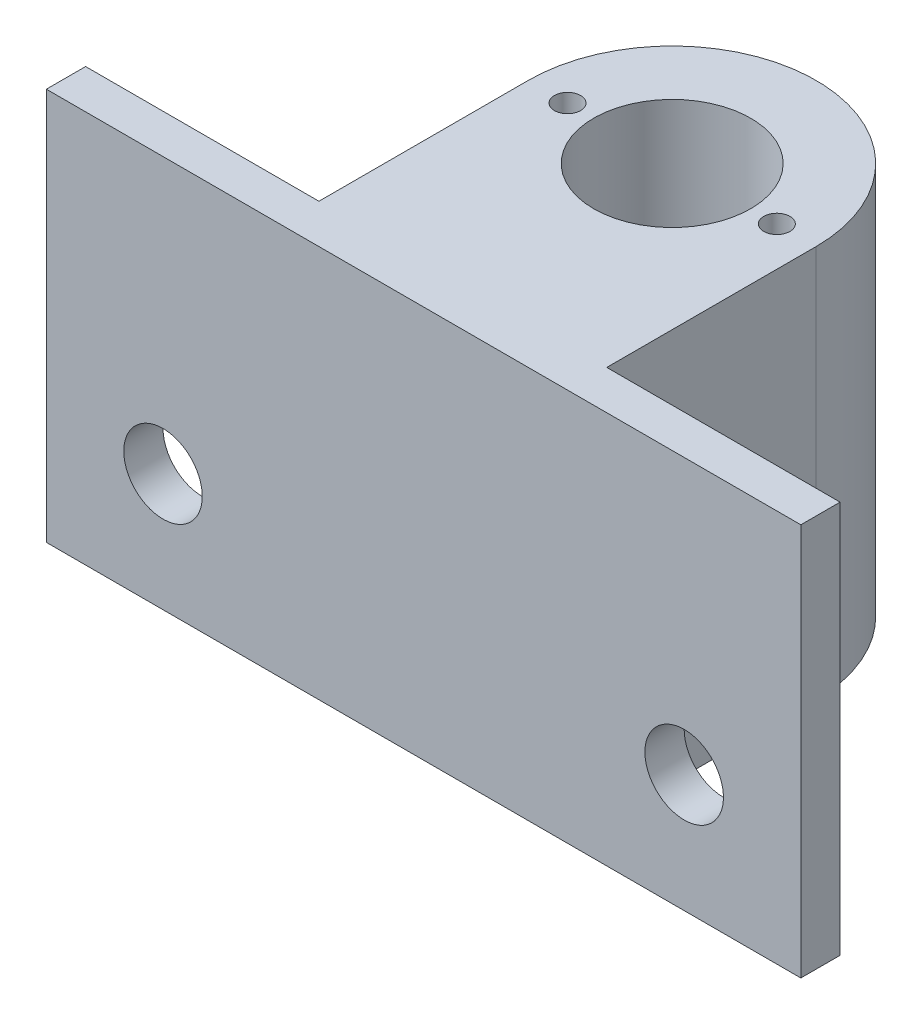
ISO-10303-21;
HEADER;
FILE_DESCRIPTION(('STEP AP214'),'2;1');
FILE_NAME('part.step','',(''),(''),'','','');
FILE_SCHEMA(('AUTOMOTIVE_DESIGN { 1 0 10303 214 1 1 1 1 }'));
ENDSEC;
DATA;
#1=APPLICATION_CONTEXT('core data for automotive mechanical design processes');
#2=APPLICATION_PROTOCOL_DEFINITION('international standard','automotive_design',2000,#1);
#3=PRODUCT_CONTEXT('',#1,'mechanical');
#4=PRODUCT('Part','Part','',(#3));
#5=PRODUCT_RELATED_PRODUCT_CATEGORY('part','',(#4));
#6=PRODUCT_DEFINITION_FORMATION('','',#4);
#7=PRODUCT_DEFINITION_CONTEXT('part definition',#1,'design');
#8=PRODUCT_DEFINITION('design','',#6,#7);
#9=PRODUCT_DEFINITION_SHAPE('','',#8);
#10=(LENGTH_UNIT() NAMED_UNIT(*) SI_UNIT(.MILLI.,.METRE.));
#11=(NAMED_UNIT(*) PLANE_ANGLE_UNIT() SI_UNIT($,.RADIAN.));
#12=(NAMED_UNIT(*) SI_UNIT($,.STERADIAN.) SOLID_ANGLE_UNIT());
#13=UNCERTAINTY_MEASURE_WITH_UNIT(LENGTH_MEASURE(1.E-05),#10,'distance_accuracy_value','');
#14=(GEOMETRIC_REPRESENTATION_CONTEXT(3) GLOBAL_UNCERTAINTY_ASSIGNED_CONTEXT((#13)) GLOBAL_UNIT_ASSIGNED_CONTEXT((#10,
#11,#12)) REPRESENTATION_CONTEXT('',''));
#15=CARTESIAN_POINT('',(0.,0.,0.));
#16=DIRECTION('',(0.,0.,1.));
#17=DIRECTION('',(1.,0.,0.));
#18=AXIS2_PLACEMENT_3D('',#15,#16,#17);
#19=CARTESIAN_POINT('',(0.,30.,0.));
#20=DIRECTION('',(0.,1.,0.));
#21=DIRECTION('',(0.,0.,1.));
#22=AXIS2_PLACEMENT_3D('',#19,#20,#21);
#23=PLANE('',#22);
#24=CARTESIAN_POINT('',(-8.00000000000006,30.,-3.99999999999992));
#25=DIRECTION('',(0.,1.,0.));
#26=DIRECTION('',(0.,0.,1.));
#27=AXIS2_PLACEMENT_3D('',#24,#25,#26);
#28=CIRCLE('',#27,1.);
#29=CARTESIAN_POINT('',(-8.00000000000006,30.,-2.99999999999992));
#30=VERTEX_POINT('',#29);
#31=EDGE_CURVE('E214',#30,#30,#28,.T.);
#32=ORIENTED_EDGE('',*,*,#31,.F.);
#33=EDGE_LOOP('',(#32));
#34=FACE_BOUND('',#33,.T.);
#35=CARTESIAN_POINT('',(7.99999999999994,30.,-3.99999999999992));
#36=DIRECTION('',(0.,1.,0.));
#37=DIRECTION('',(0.,0.,1.));
#38=AXIS2_PLACEMENT_3D('',#35,#36,#37);
#39=CIRCLE('',#38,1.);
#40=CARTESIAN_POINT('',(7.99999999999994,30.,-2.99999999999992));
#41=VERTEX_POINT('',#40);
#42=EDGE_CURVE('E205',#41,#41,#39,.T.);
#43=ORIENTED_EDGE('',*,*,#42,.F.);
#44=EDGE_LOOP('',(#43));
#45=FACE_BOUND('',#44,.T.);
#46=CARTESIAN_POINT('',(0.,30.,-3.99999999999992));
#47=DIRECTION('',(0.,1.,0.));
#48=DIRECTION('',(0.,0.,1.));
#49=AXIS2_PLACEMENT_3D('',#46,#47,#48);
#50=CIRCLE('',#49,6.);
#51=CARTESIAN_POINT('',(0.,30.,2.00000000000008));
#52=VERTEX_POINT('',#51);
#53=EDGE_CURVE('E134',#52,#52,#50,.T.);
#54=ORIENTED_EDGE('',*,*,#53,.F.);
#55=EDGE_LOOP('',(#54));
#56=FACE_BOUND('',#55,.T.);
#57=CARTESIAN_POINT('',(0.,30.,-3.99999999999992));
#58=DIRECTION('',(0.,1.,0.));
#59=DIRECTION('',(0.,0.,1.));
#60=AXIS2_PLACEMENT_3D('',#57,#58,#59);
#61=CIRCLE('',#60,11.);
#62=CARTESIAN_POINT('',(11.0000000000001,30.,-3.99999999999992));
#63=VERTEX_POINT('',#62);
#64=CARTESIAN_POINT('',(-11.0000000000001,30.,-3.99999999999992));
#65=VERTEX_POINT('',#64);
#66=EDGE_CURVE('E165',#63,#65,#61,.T.);
#67=ORIENTED_EDGE('',*,*,#66,.T.);
#68=DIRECTION('',(0.,0.,-1.));
#69=VECTOR('',#68,1.);
#70=CARTESIAN_POINT('',(-11.0000000000001,30.,0.));
#71=LINE('',#70,#69);
#72=CARTESIAN_POINT('',(-11.0000000000001,30.,12.));
#73=VERTEX_POINT('',#72);
#74=EDGE_CURVE('E190',#73,#65,#71,.T.);
#75=ORIENTED_EDGE('',*,*,#74,.F.);
#76=DIRECTION('',(1.,0.,0.));
#77=VECTOR('',#76,1.);
#78=CARTESIAN_POINT('',(0.,30.,12.));
#79=LINE('',#78,#77);
#80=CARTESIAN_POINT('',(-28.8339222614841,30.,12.));
#81=VERTEX_POINT('',#80);
#82=EDGE_CURVE('E195',#81,#73,#79,.T.);
#83=ORIENTED_EDGE('',*,*,#82,.F.);
#84=DIRECTION('',(0.,0.,1.));
#85=VECTOR('',#84,1.);
#86=CARTESIAN_POINT('',(-28.8339222614841,30.,-15.));
#87=LINE('',#86,#85);
#88=CARTESIAN_POINT('',(-28.8339222614841,30.,15.));
#89=VERTEX_POINT('',#88);
#90=EDGE_CURVE('E138',#81,#89,#87,.T.);
#91=ORIENTED_EDGE('',*,*,#90,.T.);
#92=DIRECTION('',(1.,0.,0.));
#93=VECTOR('',#92,1.);
#94=CARTESIAN_POINT('',(-28.8339222614841,30.,15.));
#95=LINE('',#94,#93);
#96=CARTESIAN_POINT('',(28.8339222614841,30.,15.));
#97=VERTEX_POINT('',#96);
#98=EDGE_CURVE('E95',#89,#97,#95,.T.);
#99=ORIENTED_EDGE('',*,*,#98,.T.);
#100=DIRECTION('',(0.,0.,-1.));
#101=VECTOR('',#100,1.);
#102=CARTESIAN_POINT('',(28.8339222614841,30.,-15.));
#103=LINE('',#102,#101);
#104=CARTESIAN_POINT('',(28.8339222614841,30.,12.));
#105=VERTEX_POINT('',#104);
#106=EDGE_CURVE('E116',#97,#105,#103,.T.);
#107=ORIENTED_EDGE('',*,*,#106,.T.);
#108=DIRECTION('',(1.,0.,0.));
#109=VECTOR('',#108,1.);
#110=CARTESIAN_POINT('',(0.,30.,12.));
#111=LINE('',#110,#109);
#112=CARTESIAN_POINT('',(11.0000000000001,30.,12.));
#113=VERTEX_POINT('',#112);
#114=EDGE_CURVE('E156',#113,#105,#111,.T.);
#115=ORIENTED_EDGE('',*,*,#114,.F.);
#116=DIRECTION('',(0.,0.,1.));
#117=VECTOR('',#116,1.);
#118=CARTESIAN_POINT('',(11.0000000000001,30.,0.));
#119=LINE('',#118,#117);
#120=EDGE_CURVE('E161',#63,#113,#119,.T.);
#121=ORIENTED_EDGE('',*,*,#120,.F.);
#122=EDGE_LOOP('',(#67,#75,#83,#91,#99,#107,#115,#121));
#123=FACE_BOUND('',#122,.T.);
#124=ADVANCED_FACE('F69',(#34,#45,#56,#123),#23,.T.);
#125=CARTESIAN_POINT('',(0.,0.,0.));
#126=DIRECTION('',(0.,1.,0.));
#127=DIRECTION('',(0.,0.,1.));
#128=AXIS2_PLACEMENT_3D('',#125,#126,#127);
#129=PLANE('',#128);
#130=CARTESIAN_POINT('',(0.,0.,-3.99999999999992));
#131=DIRECTION('',(0.,1.,0.));
#132=DIRECTION('',(0.,0.,1.));
#133=AXIS2_PLACEMENT_3D('',#130,#131,#132);
#134=CIRCLE('',#133,6.);
#135=CARTESIAN_POINT('',(0.,0.,2.00000000000008));
#136=VERTEX_POINT('',#135);
#137=EDGE_CURVE('E73',#136,#136,#134,.T.);
#138=ORIENTED_EDGE('',*,*,#137,.T.);
#139=EDGE_LOOP('',(#138));
#140=FACE_BOUND('',#139,.T.);
#141=DIRECTION('',(0.,0.,-1.));
#142=VECTOR('',#141,1.);
#143=CARTESIAN_POINT('',(-11.0000000000001,0.,0.));
#144=LINE('',#143,#142);
#145=CARTESIAN_POINT('',(-11.0000000000001,0.,12.));
#146=VERTEX_POINT('',#145);
#147=CARTESIAN_POINT('',(-11.0000000000001,0.,-3.99999999999992));
#148=VERTEX_POINT('',#147);
#149=EDGE_CURVE('E183',#146,#148,#144,.T.);
#150=ORIENTED_EDGE('',*,*,#149,.T.);
#151=CARTESIAN_POINT('',(0.,0.,-3.99999999999992));
#152=DIRECTION('',(0.,1.,0.));
#153=DIRECTION('',(0.,0.,1.));
#154=AXIS2_PLACEMENT_3D('',#151,#152,#153);
#155=CIRCLE('',#154,11.);
#156=CARTESIAN_POINT('',(11.0000000000001,0.,-3.99999999999992));
#157=VERTEX_POINT('',#156);
#158=EDGE_CURVE('E160',#157,#148,#155,.T.);
#159=ORIENTED_EDGE('',*,*,#158,.F.);
#160=DIRECTION('',(0.,0.,1.));
#161=VECTOR('',#160,1.);
#162=CARTESIAN_POINT('',(11.0000000000001,0.,0.));
#163=LINE('',#162,#161);
#164=CARTESIAN_POINT('',(11.0000000000001,0.,12.));
#165=VERTEX_POINT('',#164);
#166=EDGE_CURVE('E172',#157,#165,#163,.T.);
#167=ORIENTED_EDGE('',*,*,#166,.T.);
#168=DIRECTION('',(1.,0.,0.));
#169=VECTOR('',#168,1.);
#170=CARTESIAN_POINT('',(0.,0.,12.));
#171=LINE('',#170,#169);
#172=CARTESIAN_POINT('',(28.8339222614841,0.,12.));
#173=VERTEX_POINT('',#172);
#174=EDGE_CURVE('E86',#165,#173,#171,.T.);
#175=ORIENTED_EDGE('',*,*,#174,.T.);
#176=DIRECTION('',(0.,0.,-1.));
#177=VECTOR('',#176,1.);
#178=CARTESIAN_POINT('',(28.8339222614841,0.,-15.));
#179=LINE('',#178,#177);
#180=CARTESIAN_POINT('',(28.8339222614841,0.,15.));
#181=VERTEX_POINT('',#180);
#182=EDGE_CURVE('E122',#181,#173,#179,.T.);
#183=ORIENTED_EDGE('',*,*,#182,.F.);
#184=DIRECTION('',(1.,0.,0.));
#185=VECTOR('',#184,1.);
#186=CARTESIAN_POINT('',(-28.8339222614841,0.,15.));
#187=LINE('',#186,#185);
#188=CARTESIAN_POINT('',(-28.8339222614841,0.,15.));
#189=VERTEX_POINT('',#188);
#190=EDGE_CURVE('E107',#189,#181,#187,.T.);
#191=ORIENTED_EDGE('',*,*,#190,.F.);
#192=DIRECTION('',(0.,0.,1.));
#193=VECTOR('',#192,1.);
#194=CARTESIAN_POINT('',(-28.8339222614841,0.,-15.));
#195=LINE('',#194,#193);
#196=CARTESIAN_POINT('',(-28.8339222614841,0.,12.));
#197=VERTEX_POINT('',#196);
#198=EDGE_CURVE('E117',#197,#189,#195,.T.);
#199=ORIENTED_EDGE('',*,*,#198,.F.);
#200=DIRECTION('',(1.,0.,0.));
#201=VECTOR('',#200,1.);
#202=CARTESIAN_POINT('',(0.,0.,12.));
#203=LINE('',#202,#201);
#204=EDGE_CURVE('E194',#197,#146,#203,.T.);
#205=ORIENTED_EDGE('',*,*,#204,.T.);
#206=EDGE_LOOP('',(#150,#159,#167,#175,#183,#191,#199,#205));
#207=FACE_BOUND('',#206,.T.);
#208=ADVANCED_FACE('F126',(#140,#207),#129,.F.);
#209=CARTESIAN_POINT('',(28.8339222614841,30.,-15.));
#210=DIRECTION('',(-1.,0.,0.));
#211=DIRECTION('',(0.,0.,1.));
#212=AXIS2_PLACEMENT_3D('',#209,#210,#211);
#213=PLANE('',#212);
#214=ORIENTED_EDGE('',*,*,#182,.T.);
#215=DIRECTION('',(0.,1.,0.));
#216=VECTOR('',#215,1.);
#217=CARTESIAN_POINT('',(28.8339222614841,0.,12.));
#218=LINE('',#217,#216);
#219=EDGE_CURVE('E146',#173,#105,#218,.T.);
#220=ORIENTED_EDGE('',*,*,#219,.T.);
#221=ORIENTED_EDGE('',*,*,#106,.F.);
#222=DIRECTION('',(0.,-1.,0.));
#223=VECTOR('',#222,1.);
#224=CARTESIAN_POINT('',(28.8339222614841,30.,15.));
#225=LINE('',#224,#223);
#226=EDGE_CURVE('E79',#97,#181,#225,.T.);
#227=ORIENTED_EDGE('',*,*,#226,.T.);
#228=EDGE_LOOP('',(#214,#220,#221,#227));
#229=FACE_BOUND('',#228,.T.);
#230=ADVANCED_FACE('F71',(#229),#213,.F.);
#231=CARTESIAN_POINT('',(-28.8339222614841,30.,-15.));
#232=DIRECTION('',(1.,0.,0.));
#233=DIRECTION('',(0.,0.,-1.));
#234=AXIS2_PLACEMENT_3D('',#231,#232,#233);
#235=PLANE('',#234);
#236=ORIENTED_EDGE('',*,*,#90,.F.);
#237=DIRECTION('',(0.,1.,0.));
#238=VECTOR('',#237,1.);
#239=CARTESIAN_POINT('',(-28.8339222614841,0.,12.));
#240=LINE('',#239,#238);
#241=EDGE_CURVE('E178',#197,#81,#240,.T.);
#242=ORIENTED_EDGE('',*,*,#241,.F.);
#243=ORIENTED_EDGE('',*,*,#198,.T.);
#244=DIRECTION('',(0.,-1.,0.));
#245=VECTOR('',#244,1.);
#246=CARTESIAN_POINT('',(-28.8339222614841,30.,15.));
#247=LINE('',#246,#245);
#248=EDGE_CURVE('E12',#89,#189,#247,.T.);
#249=ORIENTED_EDGE('',*,*,#248,.F.);
#250=EDGE_LOOP('',(#236,#242,#243,#249));
#251=FACE_BOUND('',#250,.T.);
#252=ADVANCED_FACE('F287',(#251),#235,.F.);
#253=CARTESIAN_POINT('',(-28.8339222614841,30.,15.));
#254=DIRECTION('',(0.,0.,-1.));
#255=DIRECTION('',(-1.,0.,0.));
#256=AXIS2_PLACEMENT_3D('',#253,#254,#255);
#257=PLANE('',#256);
#258=CARTESIAN_POINT('',(-19.9169611307421,9.,15.));
#259=DIRECTION('',(0.,0.,-1.));
#260=DIRECTION('',(-1.,0.,0.));
#261=AXIS2_PLACEMENT_3D('',#258,#259,#260);
#262=CIRCLE('',#261,3.);
#263=CARTESIAN_POINT('',(-22.9169611307421,9.,15.));
#264=VERTEX_POINT('',#263);
#265=EDGE_CURVE('E224',#264,#264,#262,.T.);
#266=ORIENTED_EDGE('',*,*,#265,.T.);
#267=EDGE_LOOP('',(#266));
#268=FACE_BOUND('',#267,.T.);
#269=CARTESIAN_POINT('',(19.9169611307421,9.,15.));
#270=DIRECTION('',(0.,0.,-1.));
#271=DIRECTION('',(-1.,0.,0.));
#272=AXIS2_PLACEMENT_3D('',#269,#270,#271);
#273=CIRCLE('',#272,3.);
#274=CARTESIAN_POINT('',(16.9169611307421,9.,15.));
#275=VERTEX_POINT('',#274);
#276=EDGE_CURVE('E210',#275,#275,#273,.T.);
#277=ORIENTED_EDGE('',*,*,#276,.T.);
#278=EDGE_LOOP('',(#277));
#279=FACE_BOUND('',#278,.T.);
#280=ORIENTED_EDGE('',*,*,#190,.T.);
#281=ORIENTED_EDGE('',*,*,#226,.F.);
#282=ORIENTED_EDGE('',*,*,#98,.F.);
#283=ORIENTED_EDGE('',*,*,#248,.T.);
#284=EDGE_LOOP('',(#280,#281,#282,#283));
#285=FACE_BOUND('',#284,.T.);
#286=ADVANCED_FACE('F109',(#268,#279,#285),#257,.F.);
#287=CARTESIAN_POINT('',(0.,-10.,-3.99999999999992));
#288=DIRECTION('',(0.,1.,0.));
#289=DIRECTION('',(0.,0.,1.));
#290=AXIS2_PLACEMENT_3D('',#287,#288,#289);
#291=CYLINDRICAL_SURFACE('',#290,6.);
#292=ORIENTED_EDGE('',*,*,#53,.T.);
#293=EDGE_LOOP('',(#292));
#294=FACE_BOUND('',#293,.T.);
#295=ORIENTED_EDGE('',*,*,#137,.F.);
#296=EDGE_LOOP('',(#295));
#297=FACE_BOUND('',#296,.T.);
#298=ADVANCED_FACE('F293',(#294,#297),#291,.F.);
#299=CARTESIAN_POINT('',(0.,0.,-3.99999999999992));
#300=DIRECTION('',(0.,1.,0.));
#301=DIRECTION('',(0.,0.,1.));
#302=AXIS2_PLACEMENT_3D('',#299,#300,#301);
#303=CYLINDRICAL_SURFACE('',#302,11.);
#304=ORIENTED_EDGE('',*,*,#66,.F.);
#305=DIRECTION('',(0.,1.,0.));
#306=VECTOR('',#305,1.);
#307=CARTESIAN_POINT('',(11.0000000000001,0.,-3.99999999999992));
#308=LINE('',#307,#306);
#309=EDGE_CURVE('E147',#157,#63,#308,.T.);
#310=ORIENTED_EDGE('',*,*,#309,.F.);
#311=ORIENTED_EDGE('',*,*,#158,.T.);
#312=DIRECTION('',(0.,1.,0.));
#313=VECTOR('',#312,1.);
#314=CARTESIAN_POINT('',(-11.0000000000001,0.,-3.99999999999992));
#315=LINE('',#314,#313);
#316=EDGE_CURVE('E169',#148,#65,#315,.T.);
#317=ORIENTED_EDGE('',*,*,#316,.T.);
#318=EDGE_LOOP('',(#304,#310,#311,#317));
#319=FACE_BOUND('',#318,.T.);
#320=ADVANCED_FACE('F283',(#319),#303,.T.);
#321=CARTESIAN_POINT('',(0.,0.,12.));
#322=DIRECTION('',(0.,0.,1.));
#323=DIRECTION('',(1.,0.,0.));
#324=AXIS2_PLACEMENT_3D('',#321,#322,#323);
#325=PLANE('',#324);
#326=CARTESIAN_POINT('',(19.9169611307421,9.,12.));
#327=DIRECTION('',(0.,0.,-1.));
#328=DIRECTION('',(-1.,0.,0.));
#329=AXIS2_PLACEMENT_3D('',#326,#327,#328);
#330=CIRCLE('',#329,3.);
#331=CARTESIAN_POINT('',(16.9169611307421,9.,12.));
#332=VERTEX_POINT('',#331);
#333=EDGE_CURVE('E229',#332,#332,#330,.T.);
#334=ORIENTED_EDGE('',*,*,#333,.F.);
#335=EDGE_LOOP('',(#334));
#336=FACE_BOUND('',#335,.T.);
#337=ORIENTED_EDGE('',*,*,#114,.T.);
#338=ORIENTED_EDGE('',*,*,#219,.F.);
#339=ORIENTED_EDGE('',*,*,#174,.F.);
#340=DIRECTION('',(0.,1.,0.));
#341=VECTOR('',#340,1.);
#342=CARTESIAN_POINT('',(11.0000000000001,0.,12.));
#343=LINE('',#342,#341);
#344=EDGE_CURVE('E151',#165,#113,#343,.T.);
#345=ORIENTED_EDGE('',*,*,#344,.T.);
#346=EDGE_LOOP('',(#337,#338,#339,#345));
#347=FACE_BOUND('',#346,.T.);
#348=ADVANCED_FACE('F277',(#336,#347),#325,.F.);
#349=CARTESIAN_POINT('',(11.0000000000001,0.,0.));
#350=DIRECTION('',(-1.,0.,0.));
#351=DIRECTION('',(0.,0.,1.));
#352=AXIS2_PLACEMENT_3D('',#349,#350,#351);
#353=PLANE('',#352);
#354=ORIENTED_EDGE('',*,*,#120,.T.);
#355=ORIENTED_EDGE('',*,*,#344,.F.);
#356=ORIENTED_EDGE('',*,*,#166,.F.);
#357=ORIENTED_EDGE('',*,*,#309,.T.);
#358=EDGE_LOOP('',(#354,#355,#356,#357));
#359=FACE_BOUND('',#358,.T.);
#360=ADVANCED_FACE('F279',(#359),#353,.F.);
#361=CARTESIAN_POINT('',(-11.0000000000001,0.,0.));
#362=DIRECTION('',(1.,0.,0.));
#363=DIRECTION('',(0.,0.,-1.));
#364=AXIS2_PLACEMENT_3D('',#361,#362,#363);
#365=PLANE('',#364);
#366=ORIENTED_EDGE('',*,*,#74,.T.);
#367=ORIENTED_EDGE('',*,*,#316,.F.);
#368=ORIENTED_EDGE('',*,*,#149,.F.);
#369=DIRECTION('',(0.,1.,0.));
#370=VECTOR('',#369,1.);
#371=CARTESIAN_POINT('',(-11.0000000000001,0.,12.));
#372=LINE('',#371,#370);
#373=EDGE_CURVE('E182',#146,#73,#372,.T.);
#374=ORIENTED_EDGE('',*,*,#373,.T.);
#375=EDGE_LOOP('',(#366,#367,#368,#374));
#376=FACE_BOUND('',#375,.T.);
#377=ADVANCED_FACE('F244',(#376),#365,.F.);
#378=CARTESIAN_POINT('',(0.,0.,12.));
#379=DIRECTION('',(0.,0.,1.));
#380=DIRECTION('',(1.,0.,0.));
#381=AXIS2_PLACEMENT_3D('',#378,#379,#380);
#382=PLANE('',#381);
#383=CARTESIAN_POINT('',(-19.9169611307421,9.,12.));
#384=DIRECTION('',(0.,0.,-1.));
#385=DIRECTION('',(-1.,0.,0.));
#386=AXIS2_PLACEMENT_3D('',#383,#384,#385);
#387=CIRCLE('',#386,3.);
#388=CARTESIAN_POINT('',(-22.9169611307421,9.,12.));
#389=VERTEX_POINT('',#388);
#390=EDGE_CURVE('E228',#389,#389,#387,.T.);
#391=ORIENTED_EDGE('',*,*,#390,.F.);
#392=EDGE_LOOP('',(#391));
#393=FACE_BOUND('',#392,.T.);
#394=ORIENTED_EDGE('',*,*,#82,.T.);
#395=ORIENTED_EDGE('',*,*,#373,.F.);
#396=ORIENTED_EDGE('',*,*,#204,.F.);
#397=ORIENTED_EDGE('',*,*,#241,.T.);
#398=EDGE_LOOP('',(#394,#395,#396,#397));
#399=FACE_BOUND('',#398,.T.);
#400=ADVANCED_FACE('F240',(#393,#399),#382,.F.);
#401=CARTESIAN_POINT('',(7.99999999999994,20.,-3.99999999999992));
#402=DIRECTION('',(0.,1.,0.));
#403=DIRECTION('',(0.,0.,1.));
#404=AXIS2_PLACEMENT_3D('',#401,#402,#403);
#405=CYLINDRICAL_SURFACE('',#404,1.);
#406=CARTESIAN_POINT('',(7.99999999999994,20.,-3.99999999999992));
#407=DIRECTION('',(0.,1.,0.));
#408=DIRECTION('',(0.,0.,1.));
#409=AXIS2_PLACEMENT_3D('',#406,#407,#408);
#410=CIRCLE('',#409,1.);
#411=CARTESIAN_POINT('',(7.99999999999994,20.,-2.99999999999992));
#412=VERTEX_POINT('',#411);
#413=EDGE_CURVE('E209',#412,#412,#410,.T.);
#414=ORIENTED_EDGE('',*,*,#413,.F.);
#415=EDGE_LOOP('',(#414));
#416=FACE_BOUND('',#415,.T.);
#417=ORIENTED_EDGE('',*,*,#42,.T.);
#418=EDGE_LOOP('',(#417));
#419=FACE_BOUND('',#418,.T.);
#420=ADVANCED_FACE('F243',(#416,#419),#405,.F.);
#421=CARTESIAN_POINT('',(7.99999999999994,20.,-3.99999999999992));
#422=DIRECTION('',(0.,1.,0.));
#423=DIRECTION('',(0.,0.,1.));
#424=AXIS2_PLACEMENT_3D('',#421,#422,#423);
#425=PLANE('',#424);
#426=ORIENTED_EDGE('',*,*,#413,.T.);
#427=EDGE_LOOP('',(#426));
#428=FACE_BOUND('',#427,.T.);
#429=ADVANCED_FACE('F321',(#428),#425,.T.);
#430=CARTESIAN_POINT('',(-8.00000000000006,20.,-3.99999999999992));
#431=DIRECTION('',(0.,1.,0.));
#432=DIRECTION('',(0.,0.,1.));
#433=AXIS2_PLACEMENT_3D('',#430,#431,#432);
#434=CYLINDRICAL_SURFACE('',#433,1.);
#435=CARTESIAN_POINT('',(-8.00000000000006,20.,-3.99999999999992));
#436=DIRECTION('',(0.,1.,0.));
#437=DIRECTION('',(0.,0.,1.));
#438=AXIS2_PLACEMENT_3D('',#435,#436,#437);
#439=CIRCLE('',#438,1.);
#440=CARTESIAN_POINT('',(-8.00000000000006,20.,-2.99999999999992));
#441=VERTEX_POINT('',#440);
#442=EDGE_CURVE('E199',#441,#441,#439,.T.);
#443=ORIENTED_EDGE('',*,*,#442,.F.);
#444=EDGE_LOOP('',(#443));
#445=FACE_BOUND('',#444,.T.);
#446=ORIENTED_EDGE('',*,*,#31,.T.);
#447=EDGE_LOOP('',(#446));
#448=FACE_BOUND('',#447,.T.);
#449=ADVANCED_FACE('F325',(#445,#448),#434,.F.);
#450=CARTESIAN_POINT('',(-8.00000000000006,20.,-3.99999999999992));
#451=DIRECTION('',(0.,1.,0.));
#452=DIRECTION('',(0.,0.,1.));
#453=AXIS2_PLACEMENT_3D('',#450,#451,#452);
#454=PLANE('',#453);
#455=ORIENTED_EDGE('',*,*,#442,.T.);
#456=EDGE_LOOP('',(#455));
#457=FACE_BOUND('',#456,.T.);
#458=ADVANCED_FACE('F329',(#457),#454,.T.);
#459=CARTESIAN_POINT('',(-19.9169611307421,9.,22.));
#460=DIRECTION('',(0.,0.,-1.));
#461=DIRECTION('',(-1.,0.,0.));
#462=AXIS2_PLACEMENT_3D('',#459,#460,#461);
#463=CYLINDRICAL_SURFACE('',#462,3.);
#464=ORIENTED_EDGE('',*,*,#390,.T.);
#465=EDGE_LOOP('',(#464));
#466=FACE_BOUND('',#465,.T.);
#467=ORIENTED_EDGE('',*,*,#265,.F.);
#468=EDGE_LOOP('',(#467));
#469=FACE_BOUND('',#468,.T.);
#470=ADVANCED_FACE('F237',(#466,#469),#463,.F.);
#471=CARTESIAN_POINT('',(19.9169611307421,9.,22.));
#472=DIRECTION('',(0.,0.,-1.));
#473=DIRECTION('',(-1.,0.,0.));
#474=AXIS2_PLACEMENT_3D('',#471,#472,#473);
#475=CYLINDRICAL_SURFACE('',#474,3.);
#476=ORIENTED_EDGE('',*,*,#333,.T.);
#477=EDGE_LOOP('',(#476));
#478=FACE_BOUND('',#477,.T.);
#479=ORIENTED_EDGE('',*,*,#276,.F.);
#480=EDGE_LOOP('',(#479));
#481=FACE_BOUND('',#480,.T.);
#482=ADVANCED_FACE('F334',(#478,#481),#475,.F.);
#483=CLOSED_SHELL('',(#124,#208,#230,#252,#286,#298,#320,#348,#360,#377,#400,#420,#429,#449,
#458,#470,#482));
#484=MANIFOLD_SOLID_BREP('B2',#483);
#485=ADVANCED_BREP_SHAPE_REPRESENTATION('',(#18,#484),#14);
#486=SHAPE_DEFINITION_REPRESENTATION(#9,#485);
ENDSEC;
END-ISO-10303-21;
